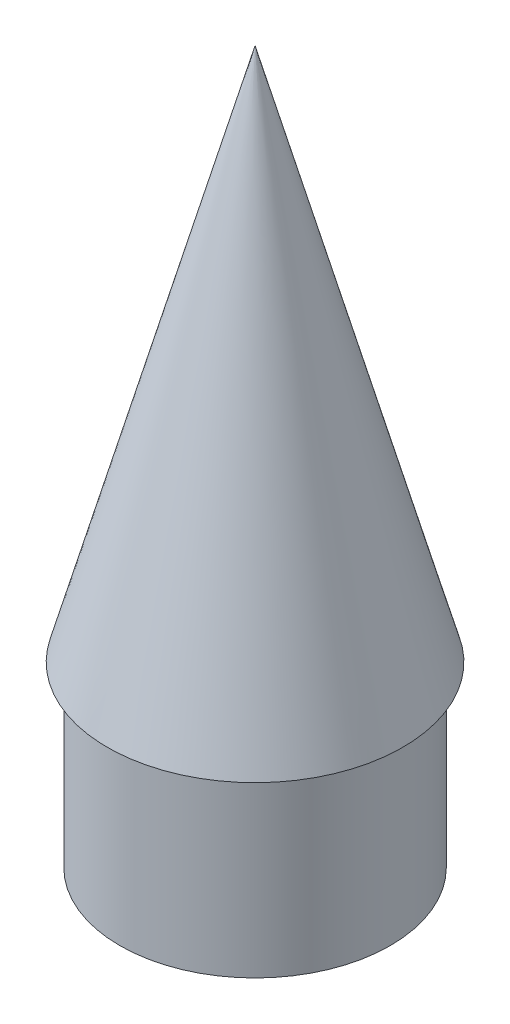
ISO-10303-21;
HEADER;
FILE_DESCRIPTION(('STEP AP214'),'2;1');
FILE_NAME('part.step','',(''),(''),'','','');
FILE_SCHEMA(('AUTOMOTIVE_DESIGN { 1 0 10303 214 1 1 1 1 }'));
ENDSEC;
DATA;
#1=APPLICATION_CONTEXT('core data for automotive mechanical design processes');
#2=APPLICATION_PROTOCOL_DEFINITION('international standard','automotive_design',2000,#1);
#3=PRODUCT_CONTEXT('',#1,'mechanical');
#4=PRODUCT('Part','Part','',(#3));
#5=PRODUCT_RELATED_PRODUCT_CATEGORY('part','',(#4));
#6=PRODUCT_DEFINITION_FORMATION('','',#4);
#7=PRODUCT_DEFINITION_CONTEXT('part definition',#1,'design');
#8=PRODUCT_DEFINITION('design','',#6,#7);
#9=PRODUCT_DEFINITION_SHAPE('','',#8);
#10=(LENGTH_UNIT() NAMED_UNIT(*) SI_UNIT(.MILLI.,.METRE.));
#11=(NAMED_UNIT(*) PLANE_ANGLE_UNIT() SI_UNIT($,.RADIAN.));
#12=(NAMED_UNIT(*) SI_UNIT($,.STERADIAN.) SOLID_ANGLE_UNIT());
#13=UNCERTAINTY_MEASURE_WITH_UNIT(LENGTH_MEASURE(1.E-05),#10,'distance_accuracy_value','');
#14=(GEOMETRIC_REPRESENTATION_CONTEXT(3) GLOBAL_UNCERTAINTY_ASSIGNED_CONTEXT((#13)) GLOBAL_UNIT_ASSIGNED_CONTEXT((#10,
#11,#12)) REPRESENTATION_CONTEXT('',''));
#15=CARTESIAN_POINT('',(0.,0.,0.));
#16=DIRECTION('',(0.,0.,1.));
#17=DIRECTION('',(1.,0.,0.));
#18=AXIS2_PLACEMENT_3D('',#15,#16,#17);
#19=CARTESIAN_POINT('',(0.,150.,0.));
#20=DIRECTION('',(0.,-1.,0.));
#21=DIRECTION('',(0.,0.,-1.));
#22=AXIS2_PLACEMENT_3D('',#19,#20,#21);
#23=CONICAL_SURFACE('',#22,0.,0.26991503643116);
#24=CARTESIAN_POINT('',(0.,0.,0.));
#25=DIRECTION('',(0.,-1.,0.));
#26=DIRECTION('',(0.,0.,-1.));
#27=AXIS2_PLACEMENT_3D('',#24,#25,#26);
#28=CIRCLE('',#27,41.5);
#29=CARTESIAN_POINT('',(0.,0.,-41.5));
#30=VERTEX_POINT('',#29);
#31=EDGE_CURVE('E103',#30,#30,#28,.T.);
#32=CARTESIAN_POINT('',(0.,149.9,0.));
#33=DIRECTION('',(0.,1.,0.));
#34=DIRECTION('',(0.,0.,1.));
#35=AXIS2_PLACEMENT_3D('',#32,#33,#34);
#36=CIRCLE('',#35,0.0276666666666713);
#37=CARTESIAN_POINT('',(0.,149.9,-0.0276666666666751));
#38=VERTEX_POINT('',#37);
#39=EDGE_CURVE('E51',#38,#38,#36,.T.);
#40=CARTESIAN_POINT('',(0.,0.,-41.5));
#41=CARTESIAN_POINT('',(0.,1.56145833333333,-41.0679965277778));
#42=CARTESIAN_POINT('',(0.,3.12291666666666,-40.6359930555556));
#43=CARTESIAN_POINT('',(0.,6.24583333333333,-39.7719861111111));
#44=CARTESIAN_POINT('',(0.,7.80729166666667,-39.3399826388889));
#45=CARTESIAN_POINT('',(0.,10.9302083333333,-38.4759756944444));
#46=CARTESIAN_POINT('',(0.,12.4916666666667,-38.0439722222222));
#47=CARTESIAN_POINT('',(0.,15.6145833333333,-37.1799652777778));
#48=CARTESIAN_POINT('',(0.,17.1760416666667,-36.7479618055556));
#49=CARTESIAN_POINT('',(0.,20.2989583333333,-35.8839548611111));
#50=CARTESIAN_POINT('',(0.,21.8604166666666,-35.4519513888889));
#51=CARTESIAN_POINT('',(0.,24.9833333333333,-34.5879444444444));
#52=CARTESIAN_POINT('',(0.,26.5447916666667,-34.1559409722222));
#53=CARTESIAN_POINT('',(0.,29.6677083333333,-33.2919340277778));
#54=CARTESIAN_POINT('',(0.,31.2291666666667,-32.8599305555556));
#55=CARTESIAN_POINT('',(0.,34.3520833333333,-31.9959236111111));
#56=CARTESIAN_POINT('',(0.,35.9135416666667,-31.5639201388889));
#57=CARTESIAN_POINT('',(0.,39.0364583333333,-30.6999131944444));
#58=CARTESIAN_POINT('',(0.,40.5979166666667,-30.2679097222222));
#59=CARTESIAN_POINT('',(0.,43.7208333333333,-29.4039027777778));
#60=CARTESIAN_POINT('',(0.,45.2822916666667,-28.9718993055556));
#61=CARTESIAN_POINT('',(0.,48.4052083333333,-28.1078923611111));
#62=CARTESIAN_POINT('',(0.,49.9666666666667,-27.6758888888889));
#63=CARTESIAN_POINT('',(0.,53.0895833333333,-26.8118819444444));
#64=CARTESIAN_POINT('',(0.,54.6510416666667,-26.3798784722222));
#65=CARTESIAN_POINT('',(0.,57.7739583333333,-25.5158715277778));
#66=CARTESIAN_POINT('',(0.,59.3354166666667,-25.0838680555556));
#67=CARTESIAN_POINT('',(0.,62.4583333333333,-24.2198611111111));
#68=CARTESIAN_POINT('',(0.,64.0197916666667,-23.7878576388889));
#69=CARTESIAN_POINT('',(0.,67.1427083333333,-22.9238506944445));
#70=CARTESIAN_POINT('',(0.,68.7041666666667,-22.4918472222222));
#71=CARTESIAN_POINT('',(0.,71.8270833333333,-21.6278402777778));
#72=CARTESIAN_POINT('',(0.,73.3885416666667,-21.1958368055556));
#73=CARTESIAN_POINT('',(0.,76.5114583333333,-20.3318298611111));
#74=CARTESIAN_POINT('',(0.,78.0729166666667,-19.8998263888889));
#75=CARTESIAN_POINT('',(0.,81.1958333333333,-19.0358194444444));
#76=CARTESIAN_POINT('',(0.,82.7572916666666,-18.6038159722222));
#77=CARTESIAN_POINT('',(0.,85.8802083333333,-17.7398090277778));
#78=CARTESIAN_POINT('',(0.,87.4416666666666,-17.3078055555556));
#79=CARTESIAN_POINT('',(0.,90.5645833333333,-16.4437986111111));
#80=CARTESIAN_POINT('',(0.,92.1260416666666,-16.0117951388889));
#81=CARTESIAN_POINT('',(0.,95.2489583333333,-15.1477881944445));
#82=CARTESIAN_POINT('',(0.,96.8104166666667,-14.7157847222222));
#83=CARTESIAN_POINT('',(0.,99.9333333333333,-13.8517777777778));
#84=CARTESIAN_POINT('',(0.,101.494791666667,-13.4197743055556));
#85=CARTESIAN_POINT('',(0.,104.617708333333,-12.5557673611111));
#86=CARTESIAN_POINT('',(0.,106.179166666667,-12.1237638888889));
#87=CARTESIAN_POINT('',(0.,109.302083333333,-11.2597569444445));
#88=CARTESIAN_POINT('',(0.,110.863541666667,-10.8277534722222));
#89=CARTESIAN_POINT('',(0.,113.986458333333,-9.96374652777779));
#90=CARTESIAN_POINT('',(0.,115.547916666667,-9.53174305555556));
#91=CARTESIAN_POINT('',(0.,118.670833333333,-8.66773611111112));
#92=CARTESIAN_POINT('',(0.,120.232291666667,-8.2357326388889));
#93=CARTESIAN_POINT('',(0.,123.355208333333,-7.37172569444446));
#94=CARTESIAN_POINT('',(0.,124.916666666667,-6.93972222222224));
#95=CARTESIAN_POINT('',(0.,128.039583333333,-6.07571527777779));
#96=CARTESIAN_POINT('',(0.,129.601041666667,-5.64371180555557));
#97=CARTESIAN_POINT('',(0.,132.723958333333,-4.77970486111112));
#98=CARTESIAN_POINT('',(0.,134.285416666667,-4.3477013888889));
#99=CARTESIAN_POINT('',(0.,137.408333333333,-3.48369444444446));
#100=CARTESIAN_POINT('',(0.,138.969791666667,-3.05169097222224));
#101=CARTESIAN_POINT('',(0.,142.092708333333,-2.18768402777779));
#102=CARTESIAN_POINT('',(0.,143.654166666667,-1.75568055555557));
#103=CARTESIAN_POINT('',(0.,146.777083333333,-0.891673611111122));
#104=CARTESIAN_POINT('',(0.,148.338541666667,-0.4596701388889));
#105=CARTESIAN_POINT('',(0.,149.9,-0.027666666666679));
#106=B_SPLINE_CURVE_WITH_KNOTS('',3,(#40,#41,#42,#43,#44,#45,#46,#47,#48,#49,#50,#51,#52,#53,
#54,#55,#56,#57,#58,#59,#60,#61,#62,#63,#64,#65,#66,#67,#68,#69,#70,#71,#72,#73,#74,#75,#76,#77,
#78,#79,#80,#81,#82,#83,#84,#85,#86,#87,#88,#89,#90,#91,#92,#93,#94,#95,#96,#97,#98,#99,#100,
#101,#102,#103,#104,#105),.UNSPECIFIED.,.F.,.F.,(4,2,2,2,2,2,2,2,2,2,2,2,2,2,2,2,2,2,2,2,2,2,2,
2,2,2,2,2,2,2,2,2,4),(0.,4.86035103060812,9.72070206121627,14.5810530918244,19.4414041224325,
24.3017551530406,29.1621061836488,34.0224572142569,38.882808244865,43.7431592754732,
48.6035103060813,53.4638613366894,58.3242123672975,63.1845633979057,68.0449144285138,
72.9052654591219,77.7656164897301,82.6259675203382,87.4863185509463,92.3466695815545,
97.2070206121626,102.067371642771,106.927722673379,111.788073703987,116.648424734595,
121.508775765203,126.369126795811,131.22947782642,136.089828857028,140.950179887636,
145.810530918244,150.670881948852,155.53123297946),.UNSPECIFIED.);
#107=EDGE_CURVE('BSEAM47',#30,#38,#106,.T.);
#108=ORIENTED_EDGE('',*,*,#31,.F.);
#109=ORIENTED_EDGE('',*,*,#39,.F.);
#110=ORIENTED_EDGE('',*,*,#107,.T.);
#111=ORIENTED_EDGE('',*,*,#107,.F.);
#112=EDGE_LOOP('',(#108,#110,#109,#111));
#113=FACE_BOUND('',#112,.T.);
#114=ADVANCED_FACE('F47',(#113),#23,.T.);
#115=CARTESIAN_POINT('',(-41.5,0.,0.));
#116=DIRECTION('',(0.,1.,0.));
#117=DIRECTION('',(0.,0.,1.));
#118=AXIS2_PLACEMENT_3D('',#115,#116,#117);
#119=PLANE('',#118);
#120=ORIENTED_EDGE('',*,*,#31,.T.);
#121=EDGE_LOOP('',(#120));
#122=FACE_BOUND('',#121,.T.);
#123=CARTESIAN_POINT('',(0.,0.,0.));
#124=DIRECTION('',(0.,1.,0.));
#125=DIRECTION('',(0.,0.,1.));
#126=AXIS2_PLACEMENT_3D('',#123,#124,#125);
#127=CIRCLE('',#126,38.);
#128=CARTESIAN_POINT('',(0.,0.,38.));
#129=VERTEX_POINT('',#128);
#130=EDGE_CURVE('E55',#129,#129,#127,.F.);
#131=ORIENTED_EDGE('',*,*,#130,.F.);
#132=EDGE_LOOP('',(#131));
#133=FACE_BOUND('',#132,.T.);
#134=ADVANCED_FACE('F77',(#122,#133),#119,.F.);
#135=CARTESIAN_POINT('',(0.,0.,0.));
#136=DIRECTION('',(0.,1.,0.));
#137=DIRECTION('',(0.,0.,1.));
#138=AXIS2_PLACEMENT_3D('',#135,#136,#137);
#139=CYLINDRICAL_SURFACE('',#138,38.);
#140=ORIENTED_EDGE('',*,*,#130,.T.);
#141=EDGE_LOOP('',(#140));
#142=FACE_BOUND('',#141,.T.);
#143=CARTESIAN_POINT('',(0.,-50.,0.));
#144=DIRECTION('',(0.,1.,0.));
#145=DIRECTION('',(0.,0.,1.));
#146=AXIS2_PLACEMENT_3D('',#143,#144,#145);
#147=CIRCLE('',#146,38.);
#148=CARTESIAN_POINT('',(0.,-50.,38.));
#149=VERTEX_POINT('',#148);
#150=EDGE_CURVE('E96',#149,#149,#147,.T.);
#151=ORIENTED_EDGE('',*,*,#150,.T.);
#152=EDGE_LOOP('',(#151));
#153=FACE_BOUND('',#152,.T.);
#154=ADVANCED_FACE('F71',(#142,#153),#139,.T.);
#155=CARTESIAN_POINT('',(0.,-50.,0.));
#156=DIRECTION('',(0.,1.,0.));
#157=DIRECTION('',(0.,0.,1.));
#158=AXIS2_PLACEMENT_3D('',#155,#156,#157);
#159=PLANE('',#158);
#160=ORIENTED_EDGE('',*,*,#150,.F.);
#161=EDGE_LOOP('',(#160));
#162=FACE_BOUND('',#161,.T.);
#163=CARTESIAN_POINT('',(0.,-50.,0.));
#164=DIRECTION('',(0.,1.,0.));
#165=DIRECTION('',(0.,0.,1.));
#166=AXIS2_PLACEMENT_3D('',#163,#164,#165);
#167=CIRCLE('',#166,33.);
#168=CARTESIAN_POINT('',(0.,-50.,33.));
#169=VERTEX_POINT('',#168);
#170=EDGE_CURVE('E98',#169,#169,#167,.T.);
#171=ORIENTED_EDGE('',*,*,#170,.T.);
#172=EDGE_LOOP('',(#171));
#173=FACE_BOUND('',#172,.T.);
#174=ADVANCED_FACE('F66',(#162,#173),#159,.F.);
#175=CARTESIAN_POINT('',(0.,2.,0.));
#176=DIRECTION('',(0.,-1.,0.));
#177=DIRECTION('',(0.,0.,-1.));
#178=AXIS2_PLACEMENT_3D('',#175,#176,#177);
#179=CYLINDRICAL_SURFACE('',#178,33.);
#180=ORIENTED_EDGE('',*,*,#170,.F.);
#181=EDGE_LOOP('',(#180));
#182=FACE_BOUND('',#181,.T.);
#183=CARTESIAN_POINT('',(0.,23.222410137869,0.));
#184=DIRECTION('',(0.,-1.,0.));
#185=DIRECTION('',(0.,0.,-1.));
#186=AXIS2_PLACEMENT_3D('',#183,#184,#185);
#187=CIRCLE('',#186,33.);
#188=CARTESIAN_POINT('',(0.,23.222410137869,-33.));
#189=VERTEX_POINT('',#188);
#190=EDGE_CURVE('E11',#189,#189,#187,.F.);
#191=ORIENTED_EDGE('',*,*,#190,.T.);
#192=EDGE_LOOP('',(#191));
#193=FACE_BOUND('',#192,.T.);
#194=ADVANCED_FACE('F62',(#182,#193),#179,.F.);
#195=CARTESIAN_POINT('',(0.,2.,0.));
#196=DIRECTION('',(0.,-1.,0.));
#197=DIRECTION('',(0.,0.,-1.));
#198=AXIS2_PLACEMENT_3D('',#195,#196,#197);
#199=CONICAL_SURFACE('',#198,38.8715334714771,0.26991503643116);
#200=CARTESIAN_POINT('',(0.,142.499518571604,0.));
#201=VERTEX_POINT('',#200);
#202=VERTEX_LOOP('',#201);
#203=FACE_BOUND('',#202,.T.);
#204=ORIENTED_EDGE('',*,*,#190,.F.);
#205=EDGE_LOOP('',(#204));
#206=FACE_BOUND('',#205,.T.);
#207=ADVANCED_FACE('F49',(#203,#206),#199,.F.);
#208=CARTESIAN_POINT('',(0.,149.9,0.));
#209=DIRECTION('',(0.,1.,0.));
#210=DIRECTION('',(0.,0.,1.));
#211=AXIS2_PLACEMENT_3D('',#208,#209,#210);
#212=PLANE('',#211);
#213=ORIENTED_EDGE('',*,*,#39,.T.);
#214=EDGE_LOOP('',(#213));
#215=FACE_BOUND('',#214,.T.);
#216=ADVANCED_FACE('F61',(#215),#212,.T.);
#217=CLOSED_SHELL('',(#114,#134,#154,#174,#194,#207,#216));
#218=MANIFOLD_SOLID_BREP('B2',#217);
#219=ADVANCED_BREP_SHAPE_REPRESENTATION('',(#18,#218),#14);
#220=SHAPE_DEFINITION_REPRESENTATION(#9,#219);
ENDSEC;
END-ISO-10303-21;
